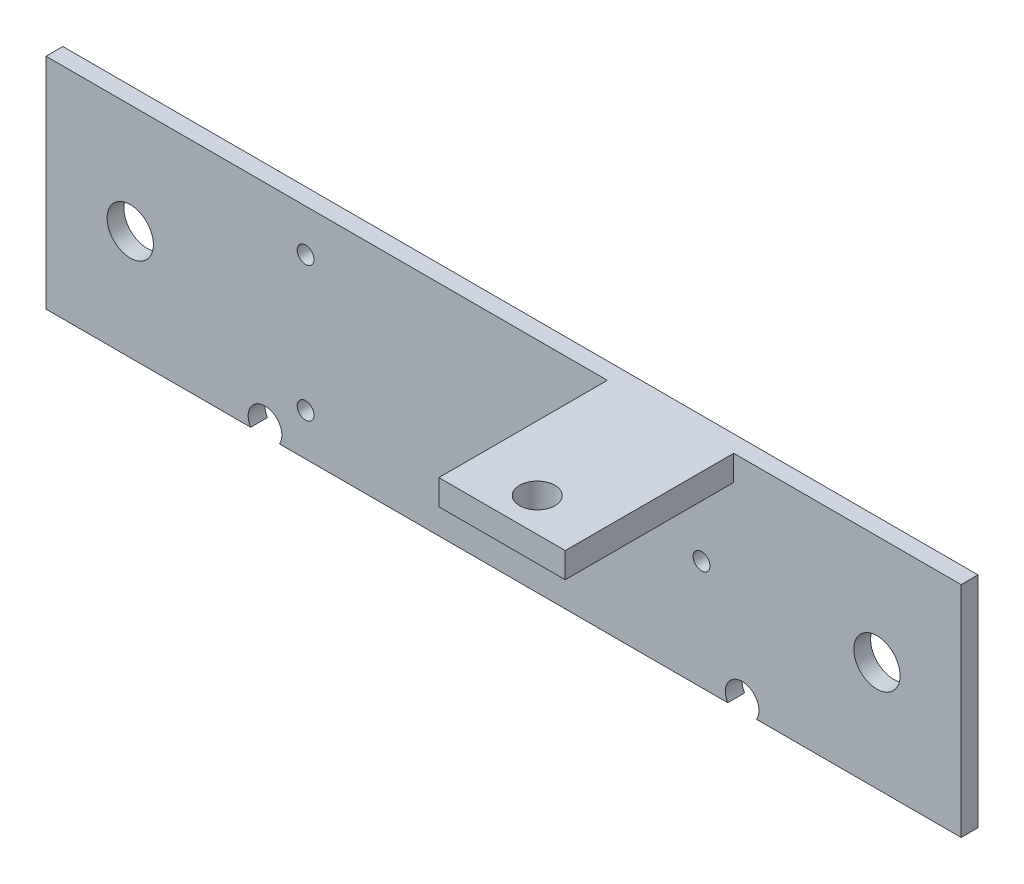
ISO-10303-21;
HEADER;
FILE_DESCRIPTION(('STEP AP214'),'2;1');
FILE_NAME('part.step','',(''),(''),'','','');
FILE_SCHEMA(('AUTOMOTIVE_DESIGN { 1 0 10303 214 1 1 1 1 }'));
ENDSEC;
DATA;
#1=APPLICATION_CONTEXT('core data for automotive mechanical design processes');
#2=APPLICATION_PROTOCOL_DEFINITION('international standard','automotive_design',2000,#1);
#3=PRODUCT_CONTEXT('',#1,'mechanical');
#4=PRODUCT('Part','Part','',(#3));
#5=PRODUCT_RELATED_PRODUCT_CATEGORY('part','',(#4));
#6=PRODUCT_DEFINITION_FORMATION('','',#4);
#7=PRODUCT_DEFINITION_CONTEXT('part definition',#1,'design');
#8=PRODUCT_DEFINITION('design','',#6,#7);
#9=PRODUCT_DEFINITION_SHAPE('','',#8);
#10=(LENGTH_UNIT() NAMED_UNIT(*) SI_UNIT(.MILLI.,.METRE.));
#11=(NAMED_UNIT(*) PLANE_ANGLE_UNIT() SI_UNIT($,.RADIAN.));
#12=(NAMED_UNIT(*) SI_UNIT($,.STERADIAN.) SOLID_ANGLE_UNIT());
#13=UNCERTAINTY_MEASURE_WITH_UNIT(LENGTH_MEASURE(1.E-05),#10,'distance_accuracy_value','');
#14=(GEOMETRIC_REPRESENTATION_CONTEXT(3) GLOBAL_UNCERTAINTY_ASSIGNED_CONTEXT((#13)) GLOBAL_UNIT_ASSIGNED_CONTEXT((#10,
#11,#12)) REPRESENTATION_CONTEXT('',''));
#15=CARTESIAN_POINT('',(0.,0.,0.));
#16=DIRECTION('',(0.,0.,1.));
#17=DIRECTION('',(1.,0.,0.));
#18=AXIS2_PLACEMENT_3D('',#15,#16,#17);
#19=CARTESIAN_POINT('',(0.,0.,2.));
#20=DIRECTION('',(0.,0.,-1.));
#21=DIRECTION('',(-1.,0.,0.));
#22=AXIS2_PLACEMENT_3D('',#19,#20,#21);
#23=PLANE('',#22);
#24=CARTESIAN_POINT('',(98.64,13.,2.));
#25=DIRECTION('',(0.,0.,1.));
#26=DIRECTION('',(1.,0.,0.));
#27=AXIS2_PLACEMENT_3D('',#24,#25,#26);
#28=CIRCLE('',#27,2.75000000000001);
#29=CARTESIAN_POINT('',(101.39,13.,2.));
#30=VERTEX_POINT('',#29);
#31=EDGE_CURVE('E191',#30,#30,#28,.T.);
#32=ORIENTED_EDGE('',*,*,#31,.F.);
#33=EDGE_LOOP('',(#32));
#34=FACE_BOUND('',#33,.T.);
#35=CARTESIAN_POINT('',(10.,13.,2.));
#36=DIRECTION('',(0.,0.,1.));
#37=DIRECTION('',(1.,0.,0.));
#38=AXIS2_PLACEMENT_3D('',#35,#36,#37);
#39=CIRCLE('',#38,2.75);
#40=CARTESIAN_POINT('',(12.75,13.,2.));
#41=VERTEX_POINT('',#40);
#42=EDGE_CURVE('E199',#41,#41,#39,.T.);
#43=ORIENTED_EDGE('',*,*,#42,.F.);
#44=EDGE_LOOP('',(#43));
#45=FACE_BOUND('',#44,.T.);
#46=CARTESIAN_POINT('',(77.82,13.,2.));
#47=DIRECTION('',(0.,0.,1.));
#48=DIRECTION('',(1.,0.,0.));
#49=AXIS2_PLACEMENT_3D('',#46,#47,#48);
#50=CIRCLE('',#49,0.999999999999998);
#51=CARTESIAN_POINT('',(78.82,13.,2.));
#52=VERTEX_POINT('',#51);
#53=EDGE_CURVE('E207',#52,#52,#50,.T.);
#54=ORIENTED_EDGE('',*,*,#53,.F.);
#55=EDGE_LOOP('',(#54));
#56=FACE_BOUND('',#55,.T.);
#57=CARTESIAN_POINT('',(30.82,5.,2.));
#58=DIRECTION('',(0.,0.,1.));
#59=DIRECTION('',(1.,0.,0.));
#60=AXIS2_PLACEMENT_3D('',#57,#58,#59);
#61=CIRCLE('',#60,0.999999999999991);
#62=CARTESIAN_POINT('',(31.82,5.,2.));
#63=VERTEX_POINT('',#62);
#64=EDGE_CURVE('E215',#63,#63,#61,.T.);
#65=ORIENTED_EDGE('',*,*,#64,.F.);
#66=EDGE_LOOP('',(#65));
#67=FACE_BOUND('',#66,.T.);
#68=CARTESIAN_POINT('',(30.82,21.,2.));
#69=DIRECTION('',(0.,0.,1.));
#70=DIRECTION('',(1.,0.,0.));
#71=AXIS2_PLACEMENT_3D('',#68,#69,#70);
#72=CIRCLE('',#71,0.999999999999991);
#73=CARTESIAN_POINT('',(31.82,21.,2.));
#74=VERTEX_POINT('',#73);
#75=EDGE_CURVE('E223',#74,#74,#72,.T.);
#76=ORIENTED_EDGE('',*,*,#75,.F.);
#77=EDGE_LOOP('',(#76));
#78=FACE_BOUND('',#77,.T.);
#79=DIRECTION('',(0.,-1.,0.));
#80=VECTOR('',#79,1.);
#81=CARTESIAN_POINT('',(66.64,26.,2.));
#82=LINE('',#81,#80);
#83=CARTESIAN_POINT('',(66.64,26.,2.));
#84=VERTEX_POINT('',#83);
#85=CARTESIAN_POINT('',(66.64,23.,2.));
#86=VERTEX_POINT('',#85);
#87=EDGE_CURVE('E65',#84,#86,#82,.T.);
#88=ORIENTED_EDGE('',*,*,#87,.F.);
#89=DIRECTION('',(-1.,0.,0.));
#90=VECTOR('',#89,1.);
#91=CARTESIAN_POINT('',(0.,26.,2.));
#92=LINE('',#91,#90);
#93=CARTESIAN_POINT('',(0.,26.,2.));
#94=VERTEX_POINT('',#93);
#95=EDGE_CURVE('E245',#84,#94,#92,.T.);
#96=ORIENTED_EDGE('',*,*,#95,.T.);
#97=DIRECTION('',(0.,-1.,0.));
#98=VECTOR('',#97,1.);
#99=CARTESIAN_POINT('',(0.,0.,2.));
#100=LINE('',#99,#98);
#101=CARTESIAN_POINT('',(0.,0.,2.));
#102=VERTEX_POINT('',#101);
#103=EDGE_CURVE('E231',#94,#102,#100,.T.);
#104=ORIENTED_EDGE('',*,*,#103,.T.);
#105=DIRECTION('',(1.,0.,0.));
#106=VECTOR('',#105,1.);
#107=CARTESIAN_POINT('',(0.,0.,2.));
#108=LINE('',#107,#106);
#109=CARTESIAN_POINT('',(24.2937877842488,0.,2.));
#110=VERTEX_POINT('',#109);
#111=EDGE_CURVE('E237',#102,#110,#108,.T.);
#112=ORIENTED_EDGE('',*,*,#111,.T.);
#113=CARTESIAN_POINT('',(26.,1.04347490378132,2.));
#114=DIRECTION('',(0.,0.,1.));
#115=DIRECTION('',(1.,0.,0.));
#116=AXIS2_PLACEMENT_3D('',#113,#114,#115);
#117=CIRCLE('',#116,2.);
#118=CARTESIAN_POINT('',(27.7062122157512,0.,2.));
#119=VERTEX_POINT('',#118);
#120=EDGE_CURVE('E176',#119,#110,#117,.T.);
#121=ORIENTED_EDGE('',*,*,#120,.F.);
#122=CARTESIAN_POINT('',(80.9337877842488,0.,2.));
#123=VERTEX_POINT('',#122);
#124=EDGE_CURVE('E242',#119,#123,#108,.T.);
#125=ORIENTED_EDGE('',*,*,#124,.T.);
#126=CARTESIAN_POINT('',(82.64,1.04347490378132,2.));
#127=DIRECTION('',(0.,0.,1.));
#128=DIRECTION('',(1.,0.,0.));
#129=AXIS2_PLACEMENT_3D('',#126,#127,#128);
#130=CIRCLE('',#129,2.);
#131=CARTESIAN_POINT('',(84.3462122157512,0.,2.));
#132=VERTEX_POINT('',#131);
#133=EDGE_CURVE('E163',#132,#123,#130,.T.);
#134=ORIENTED_EDGE('',*,*,#133,.F.);
#135=CARTESIAN_POINT('',(108.64,0.,2.));
#136=VERTEX_POINT('',#135);
#137=EDGE_CURVE('E235',#132,#136,#108,.T.);
#138=ORIENTED_EDGE('',*,*,#137,.T.);
#139=DIRECTION('',(0.,1.,0.));
#140=VECTOR('',#139,1.);
#141=CARTESIAN_POINT('',(108.64,0.,2.));
#142=LINE('',#141,#140);
#143=CARTESIAN_POINT('',(108.64,26.,2.));
#144=VERTEX_POINT('',#143);
#145=EDGE_CURVE('E241',#136,#144,#142,.T.);
#146=ORIENTED_EDGE('',*,*,#145,.T.);
#147=CARTESIAN_POINT('',(81.64,26.,2.));
#148=VERTEX_POINT('',#147);
#149=EDGE_CURVE('E246',#144,#148,#92,.T.);
#150=ORIENTED_EDGE('',*,*,#149,.T.);
#151=DIRECTION('',(0.,1.,0.));
#152=VECTOR('',#151,1.);
#153=CARTESIAN_POINT('',(81.64,26.,2.));
#154=LINE('',#153,#152);
#155=CARTESIAN_POINT('',(81.64,23.,2.));
#156=VERTEX_POINT('',#155);
#157=EDGE_CURVE('E153',#156,#148,#154,.T.);
#158=ORIENTED_EDGE('',*,*,#157,.F.);
#159=DIRECTION('',(1.,0.,0.));
#160=VECTOR('',#159,1.);
#161=CARTESIAN_POINT('',(66.64,23.,2.));
#162=LINE('',#161,#160);
#163=EDGE_CURVE('E60',#86,#156,#162,.T.);
#164=ORIENTED_EDGE('',*,*,#163,.F.);
#165=EDGE_LOOP('',(#88,#96,#104,#112,#121,#125,#134,#138,#146,#150,#158,#164));
#166=FACE_BOUND('',#165,.T.);
#167=ADVANCED_FACE('F43',(#34,#45,#56,#67,#78,#166),#23,.F.);
#168=CARTESIAN_POINT('',(0.,0.,2.));
#169=DIRECTION('',(0.,1.,0.));
#170=DIRECTION('',(0.,0.,1.));
#171=AXIS2_PLACEMENT_3D('',#168,#169,#170);
#172=PLANE('',#171);
#173=DIRECTION('',(1.,0.,0.));
#174=VECTOR('',#173,1.);
#175=CARTESIAN_POINT('',(0.,0.,0.));
#176=LINE('',#175,#174);
#177=CARTESIAN_POINT('',(0.,0.,0.));
#178=VERTEX_POINT('',#177);
#179=CARTESIAN_POINT('',(24.2937877842488,0.,0.));
#180=VERTEX_POINT('',#179);
#181=EDGE_CURVE('E254',#178,#180,#176,.T.);
#182=ORIENTED_EDGE('',*,*,#181,.T.);
#183=DIRECTION('',(0.,0.,1.));
#184=VECTOR('',#183,1.);
#185=CARTESIAN_POINT('',(24.2937877842488,0.,-0.00100000000000013));
#186=LINE('',#185,#184);
#187=EDGE_CURVE('E172',#110,#180,#186,.F.);
#188=ORIENTED_EDGE('',*,*,#187,.F.);
#189=ORIENTED_EDGE('',*,*,#111,.F.);
#190=DIRECTION('',(0.,0.,-1.));
#191=VECTOR('',#190,1.);
#192=CARTESIAN_POINT('',(0.,0.,2.));
#193=LINE('',#192,#191);
#194=EDGE_CURVE('E11',#102,#178,#193,.T.);
#195=ORIENTED_EDGE('',*,*,#194,.T.);
#196=EDGE_LOOP('',(#182,#188,#189,#195));
#197=FACE_BOUND('',#196,.T.);
#198=ADVANCED_FACE('F348',(#197),#172,.F.);
#199=ORIENTED_EDGE('',*,*,#124,.F.);
#200=DIRECTION('',(0.,0.,1.));
#201=VECTOR('',#200,1.);
#202=CARTESIAN_POINT('',(27.7062122157512,0.,-0.00100000000000013));
#203=LINE('',#202,#201);
#204=CARTESIAN_POINT('',(27.7062122157512,0.,0.));
#205=VERTEX_POINT('',#204);
#206=EDGE_CURVE('E169',#205,#119,#203,.T.);
#207=ORIENTED_EDGE('',*,*,#206,.F.);
#208=CARTESIAN_POINT('',(80.9337877842488,0.,0.));
#209=VERTEX_POINT('',#208);
#210=EDGE_CURVE('E259',#205,#209,#176,.T.);
#211=ORIENTED_EDGE('',*,*,#210,.T.);
#212=DIRECTION('',(0.,0.,1.));
#213=VECTOR('',#212,1.);
#214=CARTESIAN_POINT('',(80.9337877842488,0.,-0.00100000000000013));
#215=LINE('',#214,#213);
#216=EDGE_CURVE('E186',#123,#209,#215,.F.);
#217=ORIENTED_EDGE('',*,*,#216,.F.);
#218=EDGE_LOOP('',(#199,#207,#211,#217));
#219=FACE_BOUND('',#218,.T.);
#220=ADVANCED_FACE('F343',(#219),#172,.F.);
#221=CARTESIAN_POINT('',(0.,0.,0.));
#222=DIRECTION('',(0.,0.,-1.));
#223=DIRECTION('',(-1.,0.,0.));
#224=AXIS2_PLACEMENT_3D('',#221,#222,#223);
#225=PLANE('',#224);
#226=CARTESIAN_POINT('',(26.,1.04347490378132,0.));
#227=DIRECTION('',(0.,0.,-1.));
#228=DIRECTION('',(-1.,0.,0.));
#229=AXIS2_PLACEMENT_3D('',#226,#227,#228);
#230=CIRCLE('',#229,2.);
#231=EDGE_CURVE('E179',#205,#180,#230,.F.);
#232=ORIENTED_EDGE('',*,*,#231,.T.);
#233=ORIENTED_EDGE('',*,*,#181,.F.);
#234=DIRECTION('',(0.,-1.,0.));
#235=VECTOR('',#234,1.);
#236=CARTESIAN_POINT('',(0.,0.,0.));
#237=LINE('',#236,#235);
#238=CARTESIAN_POINT('',(0.,26.,0.));
#239=VERTEX_POINT('',#238);
#240=EDGE_CURVE('E227',#239,#178,#237,.T.);
#241=ORIENTED_EDGE('',*,*,#240,.F.);
#242=DIRECTION('',(-1.,0.,0.));
#243=VECTOR('',#242,1.);
#244=CARTESIAN_POINT('',(0.,26.,0.));
#245=LINE('',#244,#243);
#246=CARTESIAN_POINT('',(108.64,26.,0.));
#247=VERTEX_POINT('',#246);
#248=EDGE_CURVE('E236',#247,#239,#245,.T.);
#249=ORIENTED_EDGE('',*,*,#248,.F.);
#250=DIRECTION('',(0.,1.,0.));
#251=VECTOR('',#250,1.);
#252=CARTESIAN_POINT('',(108.64,0.,0.));
#253=LINE('',#252,#251);
#254=CARTESIAN_POINT('',(108.64,0.,0.));
#255=VERTEX_POINT('',#254);
#256=EDGE_CURVE('E258',#255,#247,#253,.T.);
#257=ORIENTED_EDGE('',*,*,#256,.F.);
#258=CARTESIAN_POINT('',(84.3462122157512,0.,0.));
#259=VERTEX_POINT('',#258);
#260=EDGE_CURVE('E253',#259,#255,#176,.T.);
#261=ORIENTED_EDGE('',*,*,#260,.F.);
#262=CARTESIAN_POINT('',(82.64,1.04347490378132,0.));
#263=DIRECTION('',(0.,0.,-1.));
#264=DIRECTION('',(-1.,0.,0.));
#265=AXIS2_PLACEMENT_3D('',#262,#263,#264);
#266=CIRCLE('',#265,2.);
#267=EDGE_CURVE('E157',#259,#209,#266,.F.);
#268=ORIENTED_EDGE('',*,*,#267,.T.);
#269=ORIENTED_EDGE('',*,*,#210,.F.);
#270=EDGE_LOOP('',(#232,#233,#241,#249,#257,#261,#268,#269));
#271=FACE_BOUND('',#270,.T.);
#272=CARTESIAN_POINT('',(10.,13.,0.));
#273=DIRECTION('',(0.,0.,1.));
#274=DIRECTION('',(1.,0.,0.));
#275=AXIS2_PLACEMENT_3D('',#272,#273,#274);
#276=CIRCLE('',#275,2.75);
#277=CARTESIAN_POINT('',(12.75,13.,0.));
#278=VERTEX_POINT('',#277);
#279=EDGE_CURVE('E195',#278,#278,#276,.T.);
#280=ORIENTED_EDGE('',*,*,#279,.T.);
#281=EDGE_LOOP('',(#280));
#282=FACE_BOUND('',#281,.T.);
#283=CARTESIAN_POINT('',(30.82,5.,0.));
#284=DIRECTION('',(0.,0.,1.));
#285=DIRECTION('',(1.,0.,0.));
#286=AXIS2_PLACEMENT_3D('',#283,#284,#285);
#287=CIRCLE('',#286,0.999999999999991);
#288=CARTESIAN_POINT('',(31.82,5.,0.));
#289=VERTEX_POINT('',#288);
#290=EDGE_CURVE('E211',#289,#289,#287,.T.);
#291=ORIENTED_EDGE('',*,*,#290,.T.);
#292=EDGE_LOOP('',(#291));
#293=FACE_BOUND('',#292,.T.);
#294=CARTESIAN_POINT('',(30.82,21.,0.));
#295=DIRECTION('',(0.,0.,1.));
#296=DIRECTION('',(1.,0.,0.));
#297=AXIS2_PLACEMENT_3D('',#294,#295,#296);
#298=CIRCLE('',#297,0.999999999999991);
#299=CARTESIAN_POINT('',(31.82,21.,0.));
#300=VERTEX_POINT('',#299);
#301=EDGE_CURVE('E219',#300,#300,#298,.T.);
#302=ORIENTED_EDGE('',*,*,#301,.T.);
#303=EDGE_LOOP('',(#302));
#304=FACE_BOUND('',#303,.T.);
#305=CARTESIAN_POINT('',(77.82,13.,0.));
#306=DIRECTION('',(0.,0.,1.));
#307=DIRECTION('',(1.,0.,0.));
#308=AXIS2_PLACEMENT_3D('',#305,#306,#307);
#309=CIRCLE('',#308,0.999999999999998);
#310=CARTESIAN_POINT('',(78.82,13.,0.));
#311=VERTEX_POINT('',#310);
#312=EDGE_CURVE('E203',#311,#311,#309,.T.);
#313=ORIENTED_EDGE('',*,*,#312,.T.);
#314=EDGE_LOOP('',(#313));
#315=FACE_BOUND('',#314,.T.);
#316=CARTESIAN_POINT('',(98.64,13.,0.));
#317=DIRECTION('',(0.,0.,1.));
#318=DIRECTION('',(1.,0.,0.));
#319=AXIS2_PLACEMENT_3D('',#316,#317,#318);
#320=CIRCLE('',#319,2.75000000000001);
#321=CARTESIAN_POINT('',(101.39,13.,0.));
#322=VERTEX_POINT('',#321);
#323=EDGE_CURVE('E182',#322,#322,#320,.T.);
#324=ORIENTED_EDGE('',*,*,#323,.T.);
#325=EDGE_LOOP('',(#324));
#326=FACE_BOUND('',#325,.T.);
#327=ADVANCED_FACE('F285',(#271,#282,#293,#304,#315,#326),#225,.T.);
#328=CARTESIAN_POINT('',(0.,0.,2.));
#329=DIRECTION('',(1.,0.,0.));
#330=DIRECTION('',(0.,0.,-1.));
#331=AXIS2_PLACEMENT_3D('',#328,#329,#330);
#332=PLANE('',#331);
#333=ORIENTED_EDGE('',*,*,#240,.T.);
#334=ORIENTED_EDGE('',*,*,#194,.F.);
#335=ORIENTED_EDGE('',*,*,#103,.F.);
#336=DIRECTION('',(0.,0.,-1.));
#337=VECTOR('',#336,1.);
#338=CARTESIAN_POINT('',(0.,26.,2.));
#339=LINE('',#338,#337);
#340=EDGE_CURVE('E249',#94,#239,#339,.T.);
#341=ORIENTED_EDGE('',*,*,#340,.T.);
#342=EDGE_LOOP('',(#333,#334,#335,#341));
#343=FACE_BOUND('',#342,.T.);
#344=ADVANCED_FACE('F45',(#343),#332,.F.);
#345=ORIENTED_EDGE('',*,*,#137,.F.);
#346=DIRECTION('',(0.,0.,1.));
#347=VECTOR('',#346,1.);
#348=CARTESIAN_POINT('',(84.3462122157512,0.,-0.00100000000000013));
#349=LINE('',#348,#347);
#350=EDGE_CURVE('E173',#259,#132,#349,.T.);
#351=ORIENTED_EDGE('',*,*,#350,.F.);
#352=ORIENTED_EDGE('',*,*,#260,.T.);
#353=DIRECTION('',(0.,0.,-1.));
#354=VECTOR('',#353,1.);
#355=CARTESIAN_POINT('',(108.64,0.,2.));
#356=LINE('',#355,#354);
#357=EDGE_CURVE('E53',#136,#255,#356,.T.);
#358=ORIENTED_EDGE('',*,*,#357,.F.);
#359=EDGE_LOOP('',(#345,#351,#352,#358));
#360=FACE_BOUND('',#359,.T.);
#361=ADVANCED_FACE('F335',(#360),#172,.F.);
#362=CARTESIAN_POINT('',(108.64,0.,2.));
#363=DIRECTION('',(-1.,0.,0.));
#364=DIRECTION('',(0.,0.,1.));
#365=AXIS2_PLACEMENT_3D('',#362,#363,#364);
#366=PLANE('',#365);
#367=ORIENTED_EDGE('',*,*,#256,.T.);
#368=DIRECTION('',(0.,0.,-1.));
#369=VECTOR('',#368,1.);
#370=CARTESIAN_POINT('',(108.64,26.,2.));
#371=LINE('',#370,#369);
#372=EDGE_CURVE('E267',#144,#247,#371,.T.);
#373=ORIENTED_EDGE('',*,*,#372,.F.);
#374=ORIENTED_EDGE('',*,*,#145,.F.);
#375=ORIENTED_EDGE('',*,*,#357,.T.);
#376=EDGE_LOOP('',(#367,#373,#374,#375));
#377=FACE_BOUND('',#376,.T.);
#378=ADVANCED_FACE('F278',(#377),#366,.F.);
#379=CARTESIAN_POINT('',(0.,26.,2.));
#380=DIRECTION('',(0.,-1.,0.));
#381=DIRECTION('',(0.,0.,-1.));
#382=AXIS2_PLACEMENT_3D('',#379,#380,#381);
#383=PLANE('',#382);
#384=CARTESIAN_POINT('',(74.32,26.,18.));
#385=DIRECTION('',(0.,1.,0.));
#386=DIRECTION('',(0.,0.,1.));
#387=AXIS2_PLACEMENT_3D('',#384,#385,#386);
#388=CIRCLE('',#387,2.1);
#389=CARTESIAN_POINT('',(74.32,26.,20.1));
#390=VERTEX_POINT('',#389);
#391=EDGE_CURVE('E531',#390,#390,#388,.T.);
#392=ORIENTED_EDGE('',*,*,#391,.F.);
#393=EDGE_LOOP('',(#392));
#394=FACE_BOUND('',#393,.T.);
#395=ORIENTED_EDGE('',*,*,#248,.T.);
#396=ORIENTED_EDGE('',*,*,#340,.F.);
#397=ORIENTED_EDGE('',*,*,#95,.F.);
#398=DIRECTION('',(0.,0.,-1.));
#399=VECTOR('',#398,1.);
#400=CARTESIAN_POINT('',(66.64,26.,22.));
#401=LINE('',#400,#399);
#402=CARTESIAN_POINT('',(66.64,26.,22.));
#403=VERTEX_POINT('',#402);
#404=EDGE_CURVE('E545',#403,#84,#401,.T.);
#405=ORIENTED_EDGE('',*,*,#404,.F.);
#406=DIRECTION('',(-1.,0.,0.));
#407=VECTOR('',#406,1.);
#408=CARTESIAN_POINT('',(66.64,26.,22.));
#409=LINE('',#408,#407);
#410=CARTESIAN_POINT('',(81.64,26.,22.));
#411=VERTEX_POINT('',#410);
#412=EDGE_CURVE('E148',#411,#403,#409,.T.);
#413=ORIENTED_EDGE('',*,*,#412,.F.);
#414=DIRECTION('',(0.,0.,-1.));
#415=VECTOR('',#414,1.);
#416=CARTESIAN_POINT('',(81.64,26.,22.));
#417=LINE('',#416,#415);
#418=EDGE_CURVE('E165',#411,#148,#417,.T.);
#419=ORIENTED_EDGE('',*,*,#418,.T.);
#420=ORIENTED_EDGE('',*,*,#149,.F.);
#421=ORIENTED_EDGE('',*,*,#372,.T.);
#422=EDGE_LOOP('',(#395,#396,#397,#405,#413,#419,#420,#421));
#423=FACE_BOUND('',#422,.T.);
#424=ADVANCED_FACE('F290',(#394,#423),#383,.F.);
#425=CARTESIAN_POINT('',(30.82,21.,2.));
#426=DIRECTION('',(0.,0.,-1.));
#427=DIRECTION('',(-1.,0.,0.));
#428=AXIS2_PLACEMENT_3D('',#425,#426,#427);
#429=CYLINDRICAL_SURFACE('',#428,0.999999999999991);
#430=ORIENTED_EDGE('',*,*,#75,.T.);
#431=EDGE_LOOP('',(#430));
#432=FACE_BOUND('',#431,.T.);
#433=ORIENTED_EDGE('',*,*,#301,.F.);
#434=EDGE_LOOP('',(#433));
#435=FACE_BOUND('',#434,.T.);
#436=ADVANCED_FACE('F369',(#432,#435),#429,.F.);
#437=CARTESIAN_POINT('',(30.82,5.,2.));
#438=DIRECTION('',(0.,0.,-1.));
#439=DIRECTION('',(-1.,0.,0.));
#440=AXIS2_PLACEMENT_3D('',#437,#438,#439);
#441=CYLINDRICAL_SURFACE('',#440,0.999999999999991);
#442=ORIENTED_EDGE('',*,*,#64,.T.);
#443=EDGE_LOOP('',(#442));
#444=FACE_BOUND('',#443,.T.);
#445=ORIENTED_EDGE('',*,*,#290,.F.);
#446=EDGE_LOOP('',(#445));
#447=FACE_BOUND('',#446,.T.);
#448=ADVANCED_FACE('F429',(#444,#447),#441,.F.);
#449=CARTESIAN_POINT('',(77.82,13.,2.));
#450=DIRECTION('',(0.,0.,-1.));
#451=DIRECTION('',(-1.,0.,0.));
#452=AXIS2_PLACEMENT_3D('',#449,#450,#451);
#453=CYLINDRICAL_SURFACE('',#452,0.999999999999998);
#454=ORIENTED_EDGE('',*,*,#53,.T.);
#455=EDGE_LOOP('',(#454));
#456=FACE_BOUND('',#455,.T.);
#457=ORIENTED_EDGE('',*,*,#312,.F.);
#458=EDGE_LOOP('',(#457));
#459=FACE_BOUND('',#458,.T.);
#460=ADVANCED_FACE('F438',(#456,#459),#453,.F.);
#461=CARTESIAN_POINT('',(10.,13.,2.));
#462=DIRECTION('',(0.,0.,-1.));
#463=DIRECTION('',(-1.,0.,0.));
#464=AXIS2_PLACEMENT_3D('',#461,#462,#463);
#465=CYLINDRICAL_SURFACE('',#464,2.75);
#466=ORIENTED_EDGE('',*,*,#42,.T.);
#467=EDGE_LOOP('',(#466));
#468=FACE_BOUND('',#467,.T.);
#469=ORIENTED_EDGE('',*,*,#279,.F.);
#470=EDGE_LOOP('',(#469));
#471=FACE_BOUND('',#470,.T.);
#472=ADVANCED_FACE('F447',(#468,#471),#465,.F.);
#473=CARTESIAN_POINT('',(98.64,13.,2.));
#474=DIRECTION('',(0.,0.,-1.));
#475=DIRECTION('',(-1.,0.,0.));
#476=AXIS2_PLACEMENT_3D('',#473,#474,#475);
#477=CYLINDRICAL_SURFACE('',#476,2.75000000000001);
#478=ORIENTED_EDGE('',*,*,#31,.T.);
#479=EDGE_LOOP('',(#478));
#480=FACE_BOUND('',#479,.T.);
#481=ORIENTED_EDGE('',*,*,#323,.F.);
#482=EDGE_LOOP('',(#481));
#483=FACE_BOUND('',#482,.T.);
#484=ADVANCED_FACE('F358',(#480,#483),#477,.F.);
#485=CARTESIAN_POINT('',(82.64,1.04347490378132,-0.00100000000000013));
#486=DIRECTION('',(0.,0.,1.));
#487=DIRECTION('',(1.,0.,0.));
#488=AXIS2_PLACEMENT_3D('',#485,#486,#487);
#489=CYLINDRICAL_SURFACE('',#488,2.);
#490=ORIENTED_EDGE('',*,*,#216,.T.);
#491=ORIENTED_EDGE('',*,*,#267,.F.);
#492=ORIENTED_EDGE('',*,*,#350,.T.);
#493=ORIENTED_EDGE('',*,*,#133,.T.);
#494=EDGE_LOOP('',(#490,#491,#492,#493));
#495=FACE_BOUND('',#494,.T.);
#496=ADVANCED_FACE('F338',(#495),#489,.F.);
#497=CARTESIAN_POINT('',(26.,1.04347490378132,-0.00100000000000013));
#498=DIRECTION('',(0.,0.,1.));
#499=DIRECTION('',(1.,0.,0.));
#500=AXIS2_PLACEMENT_3D('',#497,#498,#499);
#501=CYLINDRICAL_SURFACE('',#500,2.);
#502=ORIENTED_EDGE('',*,*,#187,.T.);
#503=ORIENTED_EDGE('',*,*,#231,.F.);
#504=ORIENTED_EDGE('',*,*,#206,.T.);
#505=ORIENTED_EDGE('',*,*,#120,.T.);
#506=EDGE_LOOP('',(#502,#503,#504,#505));
#507=FACE_BOUND('',#506,.T.);
#508=ADVANCED_FACE('F349',(#507),#501,.F.);
#509=CARTESIAN_POINT('',(66.64,26.,22.));
#510=DIRECTION('',(1.,0.,0.));
#511=DIRECTION('',(0.,0.,-1.));
#512=AXIS2_PLACEMENT_3D('',#509,#510,#511);
#513=PLANE('',#512);
#514=ORIENTED_EDGE('',*,*,#87,.T.);
#515=DIRECTION('',(0.,0.,-1.));
#516=VECTOR('',#515,1.);
#517=CARTESIAN_POINT('',(66.64,23.,22.));
#518=LINE('',#517,#516);
#519=CARTESIAN_POINT('',(66.64,23.,22.));
#520=VERTEX_POINT('',#519);
#521=EDGE_CURVE('E136',#520,#86,#518,.T.);
#522=ORIENTED_EDGE('',*,*,#521,.F.);
#523=DIRECTION('',(0.,-1.,0.));
#524=VECTOR('',#523,1.);
#525=CARTESIAN_POINT('',(66.64,26.,22.));
#526=LINE('',#525,#524);
#527=EDGE_CURVE('E143',#403,#520,#526,.T.);
#528=ORIENTED_EDGE('',*,*,#527,.F.);
#529=ORIENTED_EDGE('',*,*,#404,.T.);
#530=EDGE_LOOP('',(#514,#522,#528,#529));
#531=FACE_BOUND('',#530,.T.);
#532=ADVANCED_FACE('F155',(#531),#513,.F.);
#533=CARTESIAN_POINT('',(66.64,23.,22.));
#534=DIRECTION('',(0.,1.,0.));
#535=DIRECTION('',(0.,0.,1.));
#536=AXIS2_PLACEMENT_3D('',#533,#534,#535);
#537=PLANE('',#536);
#538=CARTESIAN_POINT('',(74.32,23.,18.));
#539=DIRECTION('',(0.,1.,0.));
#540=DIRECTION('',(0.,0.,1.));
#541=AXIS2_PLACEMENT_3D('',#538,#539,#540);
#542=CIRCLE('',#541,2.1);
#543=CARTESIAN_POINT('',(74.32,23.,20.1));
#544=VERTEX_POINT('',#543);
#545=EDGE_CURVE('E47',#544,#544,#542,.T.);
#546=ORIENTED_EDGE('',*,*,#545,.T.);
#547=EDGE_LOOP('',(#546));
#548=FACE_BOUND('',#547,.T.);
#549=ORIENTED_EDGE('',*,*,#163,.T.);
#550=DIRECTION('',(0.,0.,-1.));
#551=VECTOR('',#550,1.);
#552=CARTESIAN_POINT('',(81.64,23.,22.));
#553=LINE('',#552,#551);
#554=CARTESIAN_POINT('',(81.64,23.,22.));
#555=VERTEX_POINT('',#554);
#556=EDGE_CURVE('E138',#555,#156,#553,.T.);
#557=ORIENTED_EDGE('',*,*,#556,.F.);
#558=DIRECTION('',(1.,0.,0.));
#559=VECTOR('',#558,1.);
#560=CARTESIAN_POINT('',(66.64,23.,22.));
#561=LINE('',#560,#559);
#562=EDGE_CURVE('E132',#520,#555,#561,.T.);
#563=ORIENTED_EDGE('',*,*,#562,.F.);
#564=ORIENTED_EDGE('',*,*,#521,.T.);
#565=EDGE_LOOP('',(#549,#557,#563,#564));
#566=FACE_BOUND('',#565,.T.);
#567=ADVANCED_FACE('F134',(#548,#566),#537,.F.);
#568=CARTESIAN_POINT('',(81.64,26.,22.));
#569=DIRECTION('',(-1.,0.,0.));
#570=DIRECTION('',(0.,0.,1.));
#571=AXIS2_PLACEMENT_3D('',#568,#569,#570);
#572=PLANE('',#571);
#573=ORIENTED_EDGE('',*,*,#157,.T.);
#574=ORIENTED_EDGE('',*,*,#418,.F.);
#575=DIRECTION('',(0.,1.,0.));
#576=VECTOR('',#575,1.);
#577=CARTESIAN_POINT('',(81.64,26.,22.));
#578=LINE('',#577,#576);
#579=EDGE_CURVE('E142',#555,#411,#578,.T.);
#580=ORIENTED_EDGE('',*,*,#579,.F.);
#581=ORIENTED_EDGE('',*,*,#556,.T.);
#582=EDGE_LOOP('',(#573,#574,#580,#581));
#583=FACE_BOUND('',#582,.T.);
#584=ADVANCED_FACE('F494',(#583),#572,.F.);
#585=CARTESIAN_POINT('',(0.,0.,22.));
#586=DIRECTION('',(0.,0.,1.));
#587=DIRECTION('',(1.,0.,0.));
#588=AXIS2_PLACEMENT_3D('',#585,#586,#587);
#589=PLANE('',#588);
#590=ORIENTED_EDGE('',*,*,#527,.T.);
#591=ORIENTED_EDGE('',*,*,#562,.T.);
#592=ORIENTED_EDGE('',*,*,#579,.T.);
#593=ORIENTED_EDGE('',*,*,#412,.T.);
#594=EDGE_LOOP('',(#590,#591,#592,#593));
#595=FACE_BOUND('',#594,.T.);
#596=ADVANCED_FACE('F146',(#595),#589,.T.);
#597=CARTESIAN_POINT('',(74.32,11.,18.));
#598=DIRECTION('',(0.,1.,0.));
#599=DIRECTION('',(0.,0.,1.));
#600=AXIS2_PLACEMENT_3D('',#597,#598,#599);
#601=CYLINDRICAL_SURFACE('',#600,2.1);
#602=ORIENTED_EDGE('',*,*,#391,.T.);
#603=EDGE_LOOP('',(#602));
#604=FACE_BOUND('',#603,.T.);
#605=ORIENTED_EDGE('',*,*,#545,.F.);
#606=EDGE_LOOP('',(#605));
#607=FACE_BOUND('',#606,.T.);
#608=ADVANCED_FACE('F511',(#604,#607),#601,.F.);
#609=CLOSED_SHELL('',(#167,#198,#220,#327,#344,#361,#378,#424,#436,#448,#460,#472,#484,#496,
#508,#532,#567,#584,#596,#608));
#610=MANIFOLD_SOLID_BREP('B2',#609);
#611=ADVANCED_BREP_SHAPE_REPRESENTATION('',(#18,#610),#14);
#612=SHAPE_DEFINITION_REPRESENTATION(#9,#611);
ENDSEC;
END-ISO-10303-21;
